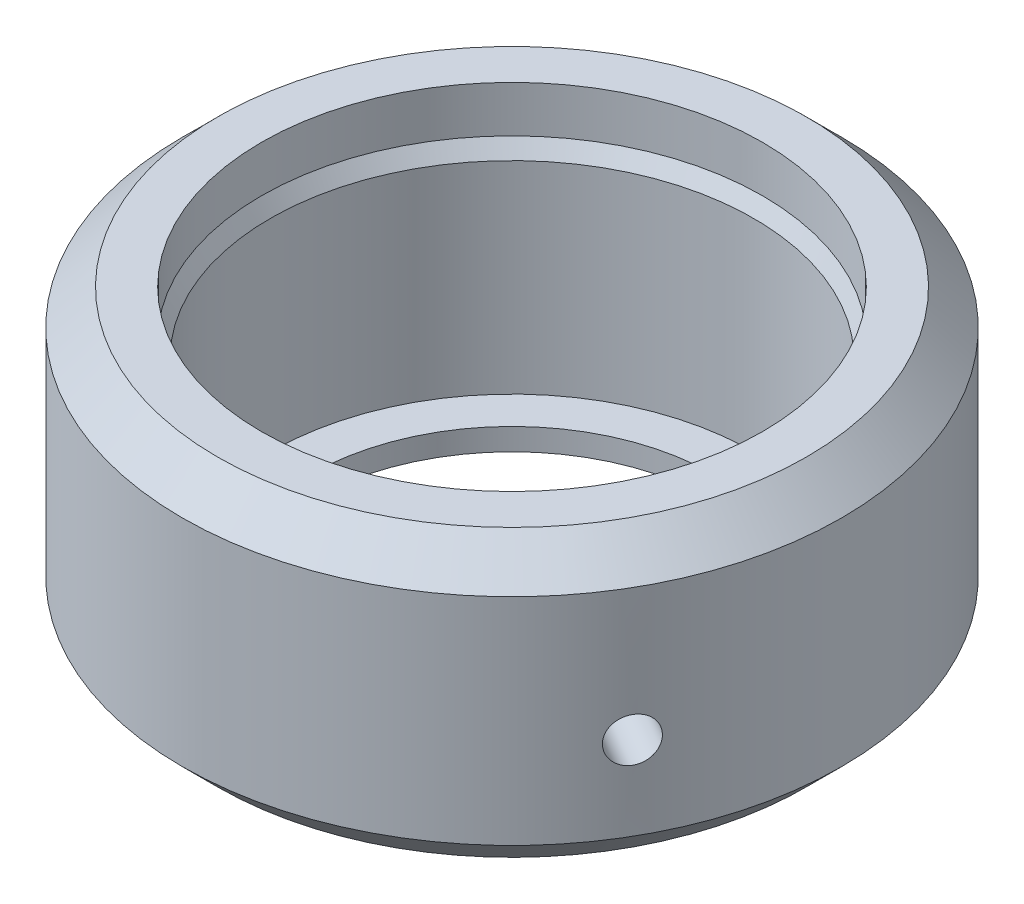
ISO-10303-21;
HEADER;
FILE_DESCRIPTION(('STEP AP214'),'2;1');
FILE_NAME('part.step','',(''),(''),'','','');
FILE_SCHEMA(('AUTOMOTIVE_DESIGN { 1 0 10303 214 1 1 1 1 }'));
ENDSEC;
DATA;
#1=APPLICATION_CONTEXT('core data for automotive mechanical design processes');
#2=APPLICATION_PROTOCOL_DEFINITION('international standard','automotive_design',2000,#1);
#3=PRODUCT_CONTEXT('',#1,'mechanical');
#4=PRODUCT('Part','Part','',(#3));
#5=PRODUCT_RELATED_PRODUCT_CATEGORY('part','',(#4));
#6=PRODUCT_DEFINITION_FORMATION('','',#4);
#7=PRODUCT_DEFINITION_CONTEXT('part definition',#1,'design');
#8=PRODUCT_DEFINITION('design','',#6,#7);
#9=PRODUCT_DEFINITION_SHAPE('','',#8);
#10=(LENGTH_UNIT() NAMED_UNIT(*) SI_UNIT(.MILLI.,.METRE.));
#11=(NAMED_UNIT(*) PLANE_ANGLE_UNIT() SI_UNIT($,.RADIAN.));
#12=(NAMED_UNIT(*) SI_UNIT($,.STERADIAN.) SOLID_ANGLE_UNIT());
#13=UNCERTAINTY_MEASURE_WITH_UNIT(LENGTH_MEASURE(1.E-05),#10,'distance_accuracy_value','');
#14=(GEOMETRIC_REPRESENTATION_CONTEXT(3) GLOBAL_UNCERTAINTY_ASSIGNED_CONTEXT((#13)) GLOBAL_UNIT_ASSIGNED_CONTEXT((#10,
#11,#12)) REPRESENTATION_CONTEXT('',''));
#15=CARTESIAN_POINT('',(0.,0.,0.));
#16=DIRECTION('',(0.,0.,1.));
#17=DIRECTION('',(1.,0.,0.));
#18=AXIS2_PLACEMENT_3D('',#15,#16,#17);
#19=CARTESIAN_POINT('',(0.,5.,0.));
#20=DIRECTION('',(0.,1.,0.));
#21=DIRECTION('',(0.,0.,1.));
#22=AXIS2_PLACEMENT_3D('',#19,#20,#21);
#23=PLANE('',#22);
#24=CARTESIAN_POINT('',(0.,5.,0.));
#25=DIRECTION('',(0.,1.,0.));
#26=DIRECTION('',(0.,0.,1.));
#27=AXIS2_PLACEMENT_3D('',#24,#25,#26);
#28=CIRCLE('',#27,46.);
#29=CARTESIAN_POINT('',(0.,5.,46.0000000000002));
#30=VERTEX_POINT('',#29);
#31=EDGE_CURVE('E17',#30,#30,#28,.F.);
#32=ORIENTED_EDGE('',*,*,#31,.T.);
#33=EDGE_LOOP('',(#32));
#34=FACE_BOUND('',#33,.T.);
#35=CARTESIAN_POINT('',(0.,5.,0.));
#36=DIRECTION('',(0.,1.,0.));
#37=DIRECTION('',(0.,0.,1.));
#38=AXIS2_PLACEMENT_3D('',#35,#36,#37);
#39=CIRCLE('',#38,55.);
#40=CARTESIAN_POINT('',(0.,5.,55.0000000000002));
#41=VERTEX_POINT('',#40);
#42=EDGE_CURVE('E115',#41,#41,#39,.T.);
#43=ORIENTED_EDGE('',*,*,#42,.T.);
#44=EDGE_LOOP('',(#43));
#45=FACE_BOUND('',#44,.T.);
#46=ADVANCED_FACE('F14',(#34,#45),#23,.T.);
#47=CARTESIAN_POINT('',(0.,54.4641016151031,0.));
#48=DIRECTION('',(0.,1.,0.));
#49=DIRECTION('',(0.,0.,1.));
#50=AXIS2_PLACEMENT_3D('',#47,#48,#49);
#51=CONICAL_SURFACE('',#50,56.9999999999946,0.523598775598);
#52=CARTESIAN_POINT('',(0.,51.,0.));
#53=DIRECTION('',(0.,1.,0.));
#54=DIRECTION('',(0.,0.,1.));
#55=AXIS2_PLACEMENT_3D('',#52,#53,#54);
#56=CIRCLE('',#55,55.);
#57=CARTESIAN_POINT('',(0.,51.,55.0000000000002));
#58=VERTEX_POINT('',#57);
#59=EDGE_CURVE('E30',#58,#58,#56,.F.);
#60=ORIENTED_EDGE('',*,*,#59,.T.);
#61=EDGE_LOOP('',(#60));
#62=FACE_BOUND('',#61,.T.);
#63=CARTESIAN_POINT('',(0.,54.4641016151,0.));
#64=DIRECTION('',(0.,1.,0.));
#65=DIRECTION('',(0.,0.,1.));
#66=AXIS2_PLACEMENT_3D('',#63,#64,#65);
#67=CIRCLE('',#66,57.);
#68=CARTESIAN_POINT('',(0.,54.4641016151,57.0000000000002));
#69=VERTEX_POINT('',#68);
#70=EDGE_CURVE('E112',#69,#69,#67,.T.);
#71=ORIENTED_EDGE('',*,*,#70,.T.);
#72=EDGE_LOOP('',(#71));
#73=FACE_BOUND('',#72,.T.);
#74=ADVANCED_FACE('F99',(#62,#73),#51,.F.);
#75=CARTESIAN_POINT('',(0.,-14.8,0.));
#76=DIRECTION('',(0.,1.,0.));
#77=DIRECTION('',(0.,0.,1.));
#78=AXIS2_PLACEMENT_3D('',#75,#76,#77);
#79=CYLINDRICAL_SURFACE('',#78,46.);
#80=CARTESIAN_POINT('',(0.,0.,0.));
#81=DIRECTION('',(0.,1.,0.));
#82=DIRECTION('',(0.,0.,1.));
#83=AXIS2_PLACEMENT_3D('',#80,#81,#82);
#84=CIRCLE('',#83,46.);
#85=CARTESIAN_POINT('',(0.,0.,46.0000000000002));
#86=VERTEX_POINT('',#85);
#87=EDGE_CURVE('E83',#86,#86,#84,.F.);
#88=ORIENTED_EDGE('',*,*,#87,.T.);
#89=EDGE_LOOP('',(#88));
#90=FACE_BOUND('',#89,.T.);
#91=ORIENTED_EDGE('',*,*,#31,.F.);
#92=EDGE_LOOP('',(#91));
#93=FACE_BOUND('',#92,.T.);
#94=ADVANCED_FACE('F96',(#90,#93),#79,.F.);
#95=CARTESIAN_POINT('',(0.,0.22679491924299,0.));
#96=DIRECTION('',(0.,1.,0.));
#97=DIRECTION('',(0.,0.,1.));
#98=AXIS2_PLACEMENT_3D('',#95,#96,#97);
#99=CYLINDRICAL_SURFACE('',#98,55.);
#100=ORIENTED_EDGE('',*,*,#42,.F.);
#101=EDGE_LOOP('',(#100));
#102=FACE_BOUND('',#101,.T.);
#103=CARTESIAN_POINT('',(49.9341649025131,27.,23.0560008563493));
#104=CARTESIAN_POINT('',(49.9341646831102,27.1400524558636,23.0560016059473));
#105=CARTESIAN_POINT('',(49.9316866792323,27.2801286113786,23.0613704849242));
#106=CARTESIAN_POINT('',(49.921779881773,27.5593390878845,23.0828080834393));
#107=CARTESIAN_POINT('',(49.9143486889914,27.6984729194302,23.0988819882195));
#108=CARTESIAN_POINT('',(49.8945413156315,27.9749887511214,23.1416356996972));
#109=CARTESIAN_POINT('',(49.8821568467968,28.1123674147542,23.1683332824835));
#110=CARTESIAN_POINT('',(49.8524789423698,28.3842029225961,23.2321238704768));
#111=CARTESIAN_POINT('',(49.8351836552419,28.5186586441388,23.2692207965018));
#112=CARTESIAN_POINT('',(49.7957718035332,28.7834637683972,23.3534423018323));
#113=CARTESIAN_POINT('',(49.7736617196796,28.9138184238086,23.4005534000239));
#114=CARTESIAN_POINT('',(49.7246754070136,29.1697369217856,23.5044666833726));
#115=CARTESIAN_POINT('',(49.6977974210375,29.295298977283,23.5612724411077));
#116=CARTESIAN_POINT('',(49.6394022951887,29.5405981238877,23.6840527514006));
#117=CARTESIAN_POINT('',(49.6078889564004,29.6603398817251,23.7500197890685));
#118=CARTESIAN_POINT('',(49.5403131644785,29.8933127354318,23.8906562787398));
#119=CARTESIAN_POINT('',(49.5042490317675,30.0065414049146,23.965328942981));
#120=CARTESIAN_POINT('',(49.4276305274475,30.2259130669552,24.1229566046697));
#121=CARTESIAN_POINT('',(49.38706551852,30.3320382806392,24.2059311752824));
#122=CARTESIAN_POINT('',(49.301669790968,30.5361945581048,24.3793909190932));
#123=CARTESIAN_POINT('',(49.2568375011666,30.6342226155753,24.4698788570723));
#124=CARTESIAN_POINT('',(49.1631301420866,30.8214247144554,24.6576080437347));
#125=CARTESIAN_POINT('',(49.1142561889423,30.9106011854254,24.7548474267759));
#126=CARTESIAN_POINT('',(49.0126639626494,31.0795321555249,24.955388355847));
#127=CARTESIAN_POINT('',(48.9599442773915,31.1592831652817,25.0586921259047));
#128=CARTESIAN_POINT('',(48.8508635838259,31.3088591290109,25.2706816586985));
#129=CARTESIAN_POINT('',(48.7944977824968,31.3786706147861,25.3793744599361));
#130=CARTESIAN_POINT('',(48.6784652876513,31.5077637936087,25.60122450016));
#131=CARTESIAN_POINT('',(48.6187973791333,31.5670415765693,25.7143833779752));
#132=CARTESIAN_POINT('',(48.496530824468,31.6745871169517,25.9442366959176));
#133=CARTESIAN_POINT('',(48.433933351637,31.7228592375172,26.0609297140937));
#134=CARTESIAN_POINT('',(48.3061549500616,31.8080866118852,26.2970239837128));
#135=CARTESIAN_POINT('',(48.2409730665323,31.8450376383845,26.4164262289521));
#136=CARTESIAN_POINT('',(48.0425739195284,31.9382470752399,26.7765886198404));
#137=CARTESIAN_POINT('',(47.9060258717884,31.9772811093191,27.0202039873204));
#138=CARTESIAN_POINT('',(47.6278765262338,32.0078811155544,27.5075274216296));
#139=CARTESIAN_POINT('',(47.4862753294995,31.9994480366877,27.7512354865081));
#140=CARTESIAN_POINT('',(47.2735075651726,31.9515812340089,28.111119446485));
#141=CARTESIAN_POINT('',(47.2025912466279,31.9297933115948,28.230024593226));
#142=CARTESIAN_POINT('',(47.0610783765542,31.8746909347558,28.4653066891305));
#143=CARTESIAN_POINT('',(46.9904817153743,31.8413807933298,28.5816845670026));
#144=CARTESIAN_POINT('',(46.8501289950334,31.7634554823515,28.8111702280207));
#145=CARTESIAN_POINT('',(46.7803732711757,31.7188359500873,28.9242767303985));
#146=CARTESIAN_POINT('',(46.6423122412645,31.6186382637428,29.1463856702374));
#147=CARTESIAN_POINT('',(46.5740064158555,31.5630641095839,29.2553895884477));
#148=CARTESIAN_POINT('',(46.4392594866768,31.4412301635672,29.4688163765051));
#149=CARTESIAN_POINT('',(46.3728220921961,31.3749506659595,29.5732303376762));
#150=CARTESIAN_POINT('',(46.2425325459328,31.2322782681089,29.7765471282466));
#151=CARTESIAN_POINT('',(46.1786794599752,31.1558890657349,29.8754519540399));
#152=CARTESIAN_POINT('',(46.0540678437818,30.9934940842435,30.0671900036576));
#153=CARTESIAN_POINT('',(45.9933102593299,30.9074853913798,30.1600213742618));
#154=CARTESIAN_POINT('',(45.8754705872488,30.7265090360886,30.3389629623674));
#155=CARTESIAN_POINT('',(45.8183871660025,30.6315446555295,30.4250756210069));
#156=CARTESIAN_POINT('',(45.708178208396,30.4329186829776,30.5903964408344));
#157=CARTESIAN_POINT('',(45.6550685357963,30.3292254137512,30.6695771223033));
#158=CARTESIAN_POINT('',(45.5535598771481,30.1142256381615,30.8201464339936));
#159=CARTESIAN_POINT('',(45.5051591688543,30.0029219407716,30.8915379141877));
#160=CARTESIAN_POINT('',(45.4134653975181,29.7733544778493,31.0261793157647));
#161=CARTESIAN_POINT('',(45.3701766452193,29.6550849624488,31.0894223698836));
#162=CARTESIAN_POINT('',(45.2891862816462,29.4125506682876,31.207286320829));
#163=CARTESIAN_POINT('',(45.2514825979058,29.2882881361751,31.2619104164079));
#164=CARTESIAN_POINT('',(45.1819650183468,29.0344330944784,31.3622985786139));
#165=CARTESIAN_POINT('',(45.1501592231565,28.9048335486517,31.4080504633292));
#166=CARTESIAN_POINT('',(45.0928290437923,28.6414347641686,31.4903045918895));
#167=CARTESIAN_POINT('',(45.0673022796642,28.5076371384685,31.526810340473));
#168=CARTESIAN_POINT('',(45.0228100827017,28.2369853358394,31.5903161351384));
#169=CARTESIAN_POINT('',(45.0038335735913,28.1001367394367,31.6173322293056));
#170=CARTESIAN_POINT('',(44.9725819798215,27.8241921578405,31.6617689349638));
#171=CARTESIAN_POINT('',(44.960303620002,27.685097305306,31.6791942360535));
#172=CARTESIAN_POINT('',(44.9456840835576,27.4548371097946,31.6999301890015));
#173=CARTESIAN_POINT('',(44.9413663255225,27.3640361798798,31.7060501769075));
#174=CARTESIAN_POINT('',(44.9356065593278,27.1821601747837,31.7142127135206));
#175=CARTESIAN_POINT('',(44.9341645516674,27.0910850995548,31.7162552615199));
#176=CARTESIAN_POINT('',(44.9341654419895,26.8599475441367,31.7162543293848));
#177=CARTESIAN_POINT('',(44.9375760256321,26.7198713886219,31.7114238755805));
#178=CARTESIAN_POINT('',(44.9511881318109,26.4406609121163,31.6921255380479));
#179=CARTESIAN_POINT('',(44.9613929452984,26.3015270805706,31.6776529839304));
#180=CARTESIAN_POINT('',(44.9885150588647,26.0250112488792,31.6391224396811));
#181=CARTESIAN_POINT('',(45.0054436093598,25.8876325852462,31.6150483836644));
#182=CARTESIAN_POINT('',(45.0458489268707,25.6157970774041,31.5574512705021));
#183=CARTESIAN_POINT('',(45.0693281636467,25.4813413558614,31.5239246494708));
#184=CARTESIAN_POINT('',(45.1225602009537,25.2165362316026,31.4476822320157));
#185=CARTESIAN_POINT('',(45.1523045668611,25.0861815761911,31.4049787886232));
#186=CARTESIAN_POINT('',(45.2178029536988,24.8302630782139,31.3105987557426));
#187=CARTESIAN_POINT('',(45.2535591899906,24.7047010227165,31.2589188582171));
#188=CARTESIAN_POINT('',(45.3306924948645,24.4594018761118,31.1469570406283));
#189=CARTESIAN_POINT('',(45.3720649559033,24.3396601182745,31.0866821698458));
#190=CARTESIAN_POINT('',(45.4600718326965,24.1066872645679,30.9578415725248));
#191=CARTESIAN_POINT('',(45.5067081905416,23.9934585950852,30.8892727853108));
#192=CARTESIAN_POINT('',(45.6049084977432,23.7740869330448,30.7441053833255));
#193=CARTESIAN_POINT('',(45.6564840792986,23.6679617193608,30.6674877697836));
#194=CARTESIAN_POINT('',(45.7640067601971,23.4638054418953,30.5068030284439));
#195=CARTESIAN_POINT('',(45.8199554683222,23.3657773844248,30.4227331575765));
#196=CARTESIAN_POINT('',(45.9356800334636,23.1785752855448,30.2477156107604));
#197=CARTESIAN_POINT('',(45.9954548328536,23.0893988145748,30.1567698342335));
#198=CARTESIAN_POINT('',(46.1183322587813,22.9204678444752,29.9685179209014));
#199=CARTESIAN_POINT('',(46.1814361053291,22.8407168347182,29.8712094491599));
#200=CARTESIAN_POINT('',(46.3104840792821,22.691140870989,29.6707480310729));
#201=CARTESIAN_POINT('',(46.3764319056978,22.621329385214,29.5675874145983));
#202=CARTESIAN_POINT('',(46.5105434289397,22.4922362063915,29.3561753062857));
#203=CARTESIAN_POINT('',(46.5787079375324,22.4329584234309,29.2479219428109));
#204=CARTESIAN_POINT('',(46.7166334726821,22.3254128830485,29.0271093414665));
#205=CARTESIAN_POINT('',(46.7863938544513,22.277140762483,28.9145518306942));
#206=CARTESIAN_POINT('',(46.9269682888418,22.191913388115,28.6858453540655));
#207=CARTESIAN_POINT('',(46.9977827247234,22.1549623616155,28.5696950644432));
#208=CARTESIAN_POINT('',(47.2104929312189,22.0617529247599,28.2177951676047));
#209=CARTESIAN_POINT('',(47.353196004339,22.0227188906809,27.9777334056846));
#210=CARTESIAN_POINT('',(47.6361558055327,21.9921188844457,27.4931872892333));
#211=CARTESIAN_POINT('',(47.7764125824572,22.0005519633123,27.2487030232155));
#212=CARTESIAN_POINT('',(47.9816973520489,22.0484187659911,26.8844987542137));
#213=CARTESIAN_POINT('',(48.0492140704954,22.0702066884052,26.7636308474407));
#214=CARTESIAN_POINT('',(48.1822179075678,22.1253090652442,26.5234360590422));
#215=CARTESIAN_POINT('',(48.2477057756535,22.1586192066703,26.4041086181019));
#216=CARTESIAN_POINT('',(48.3762698277293,22.2365445176486,26.1678167662875));
#217=CARTESIAN_POINT('',(48.439345070193,22.2811640499128,26.0508532861786));
#218=CARTESIAN_POINT('',(48.5626665395452,22.3813617362573,25.820234457083));
#219=CARTESIAN_POINT('',(48.6229137891221,22.4369358904161,25.7065779179467));
#220=CARTESIAN_POINT('',(48.7403733448386,22.5587698364328,25.4831702601674));
#221=CARTESIAN_POINT('',(48.797579790483,22.6250493340406,25.373426808201));
#222=CARTESIAN_POINT('',(48.9085125230019,22.7677217318912,25.1589343560047));
#223=CARTESIAN_POINT('',(48.9622400717167,22.8441109342652,25.0541835485587));
#224=CARTESIAN_POINT('',(49.0659842854609,23.0065059157564,24.8503976985198));
#225=CARTESIAN_POINT('',(49.1159998184464,23.0925146086199,24.7513644016098));
#226=CARTESIAN_POINT('',(49.2120479434988,23.2734909639113,24.5598414579616));
#227=CARTESIAN_POINT('',(49.2580819828447,23.3684553444707,24.4673494357079));
#228=CARTESIAN_POINT('',(49.3461495337867,23.5670813170225,24.2892452687823));
#229=CARTESIAN_POINT('',(49.388167179128,23.6707745862486,24.2036606023896));
#230=CARTESIAN_POINT('',(49.4678096987583,23.8857743618382,24.0404668694508));
#231=CARTESIAN_POINT('',(49.5054361800733,23.9970780592281,23.9628548864101));
#232=CARTESIAN_POINT('',(49.576192168572,24.2266455221507,23.8161250502758));
#233=CARTESIAN_POINT('',(49.6093178839025,24.3449150375512,23.7470143640274));
#234=CARTESIAN_POINT('',(49.6708958778254,24.5874493317125,23.6179426762385));
#235=CARTESIAN_POINT('',(49.6993498903856,24.7117118638249,23.5579782805134));
#236=CARTESIAN_POINT('',(49.7515297993158,24.9655669055217,23.4475802095027));
#237=CARTESIAN_POINT('',(49.7752491961549,25.0951664513486,23.3971596405229));
#238=CARTESIAN_POINT('',(49.8178182713719,25.3585652358319,23.3063831845099));
#239=CARTESIAN_POINT('',(49.8366697949653,25.492362861532,23.2660234840069));
#240=CARTESIAN_POINT('',(49.8694213279521,25.763014664161,23.1957392138344));
#241=CARTESIAN_POINT('',(49.8833296972571,25.8998632605636,23.165797027786));
#242=CARTESIAN_POINT('',(49.9061872163318,26.1758078421597,23.1165140008438));
#243=CARTESIAN_POINT('',(49.9151387898332,26.3149026946942,23.0971679787788));
#244=CARTESIAN_POINT('',(49.9257868836373,26.5451628902055,23.074139112352));
#245=CARTESIAN_POINT('',(49.9289280696188,26.6359638201202,23.0673398302529));
#246=CARTESIAN_POINT('',(49.9331171505843,26.8178398252162,23.0582704581025));
#247=CARTESIAN_POINT('',(49.9341650452048,26.9089149004452,23.0560003688376));
#248=CARTESIAN_POINT('',(49.9341649025131,27.,23.0560008563493));
#249=B_SPLINE_CURVE_WITH_KNOTS('',3,(#103,#104,#105,#106,#107,#108,#109,#110,#111,#112,#113,
#114,#115,#116,#117,#118,#119,#120,#121,#122,#123,#124,#125,#126,#127,#128,#129,#130,#131,#132,
#133,#134,#135,#136,#137,#138,#139,#140,#141,#142,#143,#144,#145,#146,#147,#148,#149,#150,#151,
#152,#153,#154,#155,#156,#157,#158,#159,#160,#161,#162,#163,#164,#165,#166,#167,#168,#169,#170,
#171,#172,#173,#174,#175,#176,#177,#178,#179,#180,#181,#182,#183,#184,#185,#186,#187,#188,#189,
#190,#191,#192,#193,#194,#195,#196,#197,#198,#199,#200,#201,#202,#203,#204,#205,#206,#207,#208,
#209,#210,#211,#212,#213,#214,#215,#216,#217,#218,#219,#220,#221,#222,#223,#224,#225,#226,#227,
#228,#229,#230,#231,#232,#233,#234,#235,#236,#237,#238,#239,#240,#241,#242,#243,#244,#245,#246,
#247,#248),.UNSPECIFIED.,.T.,.F.,(4,2,2,2,2,2,2,2,2,2,2,2,2,2,2,2,2,2,2,2,2,2,2,2,2,2,2,2,2,2,2,
2,2,2,2,2,2,2,2,2,2,2,2,2,2,2,2,2,2,2,2,2,2,2,2,2,2,2,2,2,2,2,2,2,2,2,2,2,2,2,2,2,4),(0.,
0.420073891223606,0.840351403678798,1.26133512336998,1.68247777863878,2.10305704063433,
2.52379162624808,2.94418310464868,3.36473019471148,3.78629326902502,4.2080121641945,
4.6296149851037,5.05137340067657,5.47369797416,5.89617898758636,6.31849221800032,
6.74096294877401,7.58264295393859,8.4243061320368,8.84434369757853,9.26422420443381,
9.68426693161968,10.1041565694483,10.524828112727,10.9453462083092,11.3659920256775,
11.7864842893233,12.2085743769585,12.6305095054295,13.0527979348018,13.4749292698354,
13.8976361673013,14.3201825975522,14.7420109739493,15.1636329057662,15.4368338669647,
15.7100348755908,16.1301087668138,16.5503862792691,16.9713699989606,17.39251265423,
17.8130919162257,18.2338265018397,18.6542179802401,19.0747650703026,19.4963281446159,
19.9180470397852,20.3396498606944,20.7614082762673,21.1837328497506,21.6062138631769,
22.0285270935907,22.4509978243642,23.2926778295292,24.1343410076279,24.5543785731697,
24.9742590800251,25.3943018072111,25.8141914450398,26.2348629883183,26.6553810839002,
27.0760269012683,27.4965191649139,27.9186092525492,28.3405443810203,28.7628328103929,
29.1849641454268,29.6076710428927,30.0302174731438,30.4520458495405,30.8736677813574,
31.1468687425557,31.4200697511817),.UNSPECIFIED.);
#250=CARTESIAN_POINT('',(49.9341649025131,27.,23.0560008563493));
#251=VERTEX_POINT('',#250);
#252=EDGE_CURVE('E79',#251,#251,#249,.T.);
#253=ORIENTED_EDGE('',*,*,#252,.T.);
#254=EDGE_LOOP('',(#253));
#255=FACE_BOUND('',#254,.T.);
#256=ORIENTED_EDGE('',*,*,#59,.F.);
#257=EDGE_LOOP('',(#256));
#258=FACE_BOUND('',#257,.T.);
#259=ADVANCED_FACE('F90',(#102,#255,#258),#99,.F.);
#260=CARTESIAN_POINT('',(0.,0.22679491924299,0.));
#261=DIRECTION('',(0.,1.,0.));
#262=DIRECTION('',(0.,0.,1.));
#263=AXIS2_PLACEMENT_3D('',#260,#261,#262);
#264=CYLINDRICAL_SURFACE('',#263,57.);
#265=ORIENTED_EDGE('',*,*,#70,.F.);
#266=EDGE_LOOP('',(#265));
#267=FACE_BOUND('',#266,.T.);
#268=CARTESIAN_POINT('',(0.,65.,0.));
#269=DIRECTION('',(0.,1.,0.));
#270=DIRECTION('',(0.,0.,1.));
#271=AXIS2_PLACEMENT_3D('',#268,#269,#270);
#272=CIRCLE('',#271,57.);
#273=CARTESIAN_POINT('',(0.,65.,57.0000000000002));
#274=VERTEX_POINT('',#273);
#275=EDGE_CURVE('E75',#274,#274,#272,.F.);
#276=ORIENTED_EDGE('',*,*,#275,.F.);
#277=EDGE_LOOP('',(#276));
#278=FACE_BOUND('',#277,.T.);
#279=ADVANCED_FACE('F95',(#267,#278),#264,.F.);
#280=CARTESIAN_POINT('',(0.,0.,0.));
#281=DIRECTION('',(0.,1.,0.));
#282=DIRECTION('',(0.,0.,1.));
#283=AXIS2_PLACEMENT_3D('',#280,#281,#282);
#284=PLANE('',#283);
#285=ORIENTED_EDGE('',*,*,#87,.F.);
#286=EDGE_LOOP('',(#285));
#287=FACE_BOUND('',#286,.T.);
#288=CARTESIAN_POINT('',(0.,0.,0.));
#289=DIRECTION('',(0.,1.,0.));
#290=DIRECTION('',(0.,0.,1.));
#291=AXIS2_PLACEMENT_3D('',#288,#289,#290);
#292=CIRCLE('',#291,66.9999862654897);
#293=CARTESIAN_POINT('',(0.,0.,66.99998626549));
#294=VERTEX_POINT('',#293);
#295=EDGE_CURVE('E45',#294,#294,#292,.T.);
#296=ORIENTED_EDGE('',*,*,#295,.F.);
#297=EDGE_LOOP('',(#296));
#298=FACE_BOUND('',#297,.T.);
#299=ADVANCED_FACE('F70',(#287,#298),#284,.F.);
#300=CARTESIAN_POINT('',(64.9519052838002,27.,37.5000000000001));
#301=DIRECTION('',(-0.866025403784333,0.,-0.500000000000192));
#302=DIRECTION('',(-0.500000000000192,0.,0.866025403784333));
#303=AXIS2_PLACEMENT_3D('',#300,#301,#302);
#304=CYLINDRICAL_SURFACE('',#303,5.);
#305=CARTESIAN_POINT('',(62.3074069840701,27.,41.7467008866759));
#306=CARTESIAN_POINT('',(62.3074074861112,27.1401994469576,41.7467002911992));
#307=CARTESIAN_POINT('',(62.3106999599185,27.2804233951994,41.7417873824171));
#308=CARTESIAN_POINT('',(62.323843281868,27.5599302769908,41.7221607084198));
#309=CARTESIAN_POINT('',(62.333697333337,27.6992127173359,41.7074421561408));
#310=CARTESIAN_POINT('',(62.359896051621,27.976028719541,41.6682603521341));
#311=CARTESIAN_POINT('',(62.3762516889803,28.1135589178318,41.6437806295385));
#312=CARTESIAN_POINT('',(62.415307418382,28.3856967596065,41.5852213803083));
#313=CARTESIAN_POINT('',(62.4380099004095,28.5203032815251,41.5511382373459));
#314=CARTESIAN_POINT('',(62.4895120149786,28.7854143956203,41.4736428107761));
#315=CARTESIAN_POINT('',(62.5183038236182,28.9159240069548,41.430242497315));
#316=CARTESIAN_POINT('',(62.5817482069081,29.1721440348353,41.3343452317404));
#317=CARTESIAN_POINT('',(62.6164029415956,29.2978526615891,41.2818449268043));
#318=CARTESIAN_POINT('',(62.6912183925425,29.5434290589724,41.1681401283053));
#319=CARTESIAN_POINT('',(62.7313745261002,29.6633015796371,41.1069428777884));
#320=CARTESIAN_POINT('',(62.8168688814519,29.8965153291553,40.9761770512114));
#321=CARTESIAN_POINT('',(62.8622090131763,30.009854127519,40.9066053892815));
#322=CARTESIAN_POINT('',(62.9577143990442,30.2292873172563,40.7594638962406));
#323=CARTESIAN_POINT('',(63.007885459826,30.3353727217422,40.6818844317144));
#324=CARTESIAN_POINT('',(63.1125847140798,30.5394359359608,40.5192670571246));
#325=CARTESIAN_POINT('',(63.1671145105731,30.6374107356226,40.4342264019104));
#326=CARTESIAN_POINT('',(63.2800271290261,30.8244897774912,40.2572872241692));
#327=CARTESIAN_POINT('',(63.3384088724223,30.9135964854236,40.1653906204059));
#328=CARTESIAN_POINT('',(63.4585638009291,31.0823704039535,39.9752839517125));
#329=CARTESIAN_POINT('',(63.5203382300092,31.1620341178896,39.8770715687384));
#330=CARTESIAN_POINT('',(63.646775006089,31.3113573319504,39.6749573884015));
#331=CARTESIAN_POINT('',(63.7114388662406,31.3810115077936,39.5710526034193));
#332=CARTESIAN_POINT('',(63.8431138234917,31.5097919133777,39.3582581000633));
#333=CARTESIAN_POINT('',(63.9101257801332,31.5689142386251,39.2493665516661));
#334=CARTESIAN_POINT('',(64.0459112586071,31.6761551761755,39.0274025779542));
#335=CARTESIAN_POINT('',(64.1146840826765,31.7242780743165,38.9143318010609));
#336=CARTESIAN_POINT('',(64.2534751677,31.8092171999472,38.6847383654824));
#337=CARTESIAN_POINT('',(64.3234938843054,31.8460291969741,38.5682144330829));
#338=CARTESIAN_POINT('',(64.534326996492,31.9389240389083,38.2151191460154));
#339=CARTESIAN_POINT('',(64.6762730720846,31.9777446610178,37.9744454728639));
#340=CARTESIAN_POINT('',(64.9586925587563,32.0078785442037,37.4892920829424));
#341=CARTESIAN_POINT('',(65.0991659856975,31.9991923175098,37.2448124072381));
#342=CARTESIAN_POINT('',(65.3055882374115,31.9508965648093,36.8808861614255));
#343=CARTESIAN_POINT('',(65.3736638473385,31.9289305459991,36.7600740355215));
#344=CARTESIAN_POINT('',(65.508005076198,31.8734301566731,36.5201329772486));
#345=CARTESIAN_POINT('',(65.5742713625433,31.8399001157823,36.4010034322655));
#346=CARTESIAN_POINT('',(65.7045921115779,31.7614928874274,36.1652421986606));
#347=CARTESIAN_POINT('',(65.76864571357,31.7166113396702,36.0486114885963));
#348=CARTESIAN_POINT('',(65.8940961689231,31.6158478634393,35.818783065464));
#349=CARTESIAN_POINT('',(65.9554939878313,31.5599699745472,35.7055841092883));
#350=CARTESIAN_POINT('',(66.0753574380405,31.4375278369065,35.4832792879563));
#351=CARTESIAN_POINT('',(66.1338194615708,31.3709508424793,35.3741784985544));
#352=CARTESIAN_POINT('',(66.2473706910374,31.2276587584922,35.1610644214211));
#353=CARTESIAN_POINT('',(66.3024611261532,31.1509473962229,35.0570492824301));
#354=CARTESIAN_POINT('',(66.4089985915394,30.9878873826605,34.8548127988403));
#355=CARTESIAN_POINT('',(66.4604445452444,30.9015359029581,34.7565931676313));
#356=CARTESIAN_POINT('',(66.5593780148241,30.7198582192045,34.5667564779847));
#357=CARTESIAN_POINT('',(66.6068669763501,30.6245353201244,34.4751370099089));
#358=CARTESIAN_POINT('',(66.6977554627325,30.4253486104688,34.2989688470938));
#359=CARTESIAN_POINT('',(66.7411460838704,30.3214670823713,34.2144355901168));
#360=CARTESIAN_POINT('',(66.8234873741323,30.1061140258596,34.0533363760884));
#361=CARTESIAN_POINT('',(66.8624396710157,29.9946453041694,33.9767674989971));
#362=CARTESIAN_POINT('',(66.9357611767426,29.7647750296689,33.8320921722316));
#363=CARTESIAN_POINT('',(66.9701265084102,29.646367732082,33.7639928848336));
#364=CARTESIAN_POINT('',(67.0340579697724,29.4035895002709,33.6368865036271));
#365=CARTESIAN_POINT('',(67.0636258735213,29.2792207926738,33.5778760492449));
#366=CARTESIAN_POINT('',(67.1178732325255,29.0251994447716,33.4693110480966));
#367=CARTESIAN_POINT('',(67.1425464159366,28.895540278629,33.4197686361357));
#368=CARTESIAN_POINT('',(67.1868345983051,28.6320588432694,33.3306425710747));
#369=CARTESIAN_POINT('',(67.2064515063953,28.4982381667934,33.2910551593346));
#370=CARTESIAN_POINT('',(67.2405207487786,28.2275767956956,33.2221890211942));
#371=CARTESIAN_POINT('',(67.2549818232517,28.0907416335025,33.1928928503146));
#372=CARTESIAN_POINT('',(67.2787156723391,27.8148567991697,33.1447603955084));
#373=CARTESIAN_POINT('',(67.2879909905841,27.6758082471892,33.1259189835218));
#374=CARTESIAN_POINT('',(67.2989043125698,27.4471276494529,33.1037394138415));
#375=CARTESIAN_POINT('',(67.3020921105016,27.3578597473958,33.097256998819));
#376=CARTESIAN_POINT('',(67.3063435308543,27.179064561302,33.0886104822335));
#377=CARTESIAN_POINT('',(67.3074071531056,27.0895372772445,33.0864463810151));
#378=CARTESIAN_POINT('',(67.3074067193938,26.8598005530423,33.0864475813513));
#379=CARTESIAN_POINT('',(67.3047982524864,26.7195766048005,33.0917554017005));
#380=CARTESIAN_POINT('',(67.2943727151883,26.440069723009,33.1129511893974));
#381=CARTESIAN_POINT('',(67.286553100742,26.300787282664,33.1288443244392));
#382=CARTESIAN_POINT('',(67.265720022248,26.023971280459,33.1711239820232));
#383=CARTESIAN_POINT('',(67.2526977792821,25.8864410821681,33.1975282407692));
#384=CARTESIAN_POINT('',(67.2215118465232,25.6143032403934,33.2606311192095));
#385=CARTESIAN_POINT('',(67.2033462198907,25.4796967184749,33.2973336168555));
#386=CARTESIAN_POINT('',(67.1619842690887,25.2145856043797,33.3806834697058));
#387=CARTESIAN_POINT('',(67.1387943994189,25.0840759930453,33.4273180641392));
#388=CARTESIAN_POINT('',(67.0874671229227,24.8278559651647,33.5302111445829));
#389=CARTESIAN_POINT('',(67.0593278924854,24.702147338411,33.5864731776517));
#390=CARTESIAN_POINT('',(66.9982643739264,24.4565709410277,33.7081176580168));
#391=CARTESIAN_POINT('',(66.9653440671158,24.3366984203631,33.773492515054));
#392=CARTESIAN_POINT('',(66.8948447170292,24.1034846708448,33.912915711957));
#393=CARTESIAN_POINT('',(66.8572639562767,23.990145872481,33.9869672488063));
#394=CARTESIAN_POINT('',(66.7775883782865,23.7707126827437,34.1432480856866));
#395=CARTESIAN_POINT('',(66.7354881215854,23.6646272782578,34.2254872311215));
#396=CARTESIAN_POINT('',(66.6470069712205,23.4605640640392,34.3974681323575));
#397=CARTESIAN_POINT('',(66.6006245016972,23.3625892643773,34.487212648991));
#398=CARTESIAN_POINT('',(66.5038469880751,23.1755102225087,34.6734674338497));
#399=CARTESIAN_POINT('',(66.4534530663928,23.0864035145762,34.7699758086298));
#400=CARTESIAN_POINT('',(66.3488933261283,22.9176295960464,34.9690863634532));
#401=CARTESIAN_POINT('',(66.294726122046,22.8379658821104,35.0716907798277));
#402=CARTESIAN_POINT('',(66.1829084954489,22.6886426680496,35.2822453300538));
#403=CARTESIAN_POINT('',(66.1252562421559,22.6189884922063,35.3901982681432));
#404=CARTESIAN_POINT('',(66.0068082750898,22.4902080866221,35.6106293778429));
#405=CARTESIAN_POINT('',(65.9460114062409,22.4310857613748,35.7231092088503));
#406=CARTESIAN_POINT('',(65.8216777055183,22.3238448238245,35.9516848695295));
#407=CARTESIAN_POINT('',(65.7581419523377,22.2757219256834,36.0677792707103));
#408=CARTESIAN_POINT('',(65.6287037470962,22.1907828000528,36.3027725939486));
#409=CARTESIAN_POINT('',(65.5628004197919,22.1539708030259,36.4216725474689));
#410=CARTESIAN_POINT('',(65.362427487328,22.0610759610918,36.7808070221151));
#411=CARTESIAN_POINT('',(65.224971010153,22.0222553389822,37.0240727661216));
#412=CARTESIAN_POINT('',(64.9460255930845,21.9921214557962,37.5112319110638));
#413=CARTESIAN_POINT('',(64.8045366966858,22.0008076824901,37.7551253052036));
#414=CARTESIAN_POINT('',(64.5925784485651,22.0491034351907,38.1158553420006));
#415=CARTESIAN_POINT('',(64.5219898834105,22.071069454001,38.2352166125275));
#416=CARTESIAN_POINT('',(64.381365445965,22.126569843327,38.4715300586318));
#417=CARTESIAN_POINT('',(64.311329376841,22.1600998842178,38.5884831185127));
#418=CARTESIAN_POINT('',(64.1723145338288,22.2385071125727,38.8192248146193));
#419=CARTESIAN_POINT('',(64.1033361770478,22.2833886603299,38.9330122161804));
#420=CARTESIAN_POINT('',(63.9670241517799,22.3841521365607,39.1565697089985));
#421=CARTESIAN_POINT('',(63.8996898895038,22.4400300254528,39.2663412579977));
#422=CARTESIAN_POINT('',(63.7670999919511,22.5624721630935,39.48129846153));
#423=CARTESIAN_POINT('',(63.7018469485213,22.6290491575207,39.5864784537648));
#424=CARTESIAN_POINT('',(63.5740603585532,22.7723412415078,39.7913737416805));
#425=CARTESIAN_POINT('',(63.5115258233666,22.8490526037771,39.8910910274917));
#426=CARTESIAN_POINT('',(63.3896526236987,23.0121126173395,40.0844734207658));
#427=CARTESIAN_POINT('',(63.3303149047739,23.0984640970419,40.1781367392007));
#428=CARTESIAN_POINT('',(63.2153782437594,23.2801417807955,40.3587339819645));
#429=CARTESIAN_POINT('',(63.1597779376875,23.3754646798756,40.4456703630833));
#430=CARTESIAN_POINT('',(63.0526560765427,23.5746513895312,40.6124661826095));
#431=CARTESIAN_POINT('',(63.0011434391048,23.6785329176287,40.6923101912894));
#432=CARTESIAN_POINT('',(62.9027980723574,23.8938859741405,40.8441694474508));
#433=CARTESIAN_POINT('',(62.8559636280987,24.0053546958308,40.9161875646332));
#434=CARTESIAN_POINT('',(62.7673318726824,24.2352249703313,41.0520235146191));
#435=CARTESIAN_POINT('',(62.72553882565,24.3536322679183,41.1158344085517));
#436=CARTESIAN_POINT('',(62.6474272012229,24.5964104997293,41.2347538687958));
#437=CARTESIAN_POINT('',(62.6111066005132,24.7207792073262,41.2898656517702));
#438=CARTESIAN_POINT('',(62.5442102310589,24.9748005552284,41.3911277433301));
#439=CARTESIAN_POINT('',(62.5136418354419,25.1044597213711,41.4372665529366));
#440=CARTESIAN_POINT('',(62.4586004901442,25.3679411567307,41.5201842764854));
#441=CARTESIAN_POINT('',(62.4341252399521,25.5017618332066,41.5569667231053));
#442=CARTESIAN_POINT('',(62.3915200360537,25.7724232043044,41.6209046215673));
#443=CARTESIAN_POINT('',(62.373379345075,25.9092583664975,41.6480763648669));
#444=CARTESIAN_POINT('',(62.3435623410098,26.1851432008303,41.6926967085089));
#445=CARTESIAN_POINT('',(62.3318828587083,26.3241917528108,41.7101500757303));
#446=CARTESIAN_POINT('',(62.3181314489131,26.5528723505471,41.7306910746497));
#447=CARTESIAN_POINT('',(62.3141114117919,26.6421402526042,41.7366929961522));
#448=CARTESIAN_POINT('',(62.3087490189512,26.820935438698,41.7446980924731));
#449=CARTESIAN_POINT('',(62.3074066634455,26.9104627227555,41.7467012669725));
#450=CARTESIAN_POINT('',(62.3074069840701,27.,41.7467008866759));
#451=B_SPLINE_CURVE_WITH_KNOTS('',3,(#305,#306,#307,#308,#309,#310,#311,#312,#313,#314,#315,
#316,#317,#318,#319,#320,#321,#322,#323,#324,#325,#326,#327,#328,#329,#330,#331,#332,#333,#334,
#335,#336,#337,#338,#339,#340,#341,#342,#343,#344,#345,#346,#347,#348,#349,#350,#351,#352,#353,
#354,#355,#356,#357,#358,#359,#360,#361,#362,#363,#364,#365,#366,#367,#368,#369,#370,#371,#372,
#373,#374,#375,#376,#377,#378,#379,#380,#381,#382,#383,#384,#385,#386,#387,#388,#389,#390,#391,
#392,#393,#394,#395,#396,#397,#398,#399,#400,#401,#402,#403,#404,#405,#406,#407,#408,#409,#410,
#411,#412,#413,#414,#415,#416,#417,#418,#419,#420,#421,#422,#423,#424,#425,#426,#427,#428,#429,
#430,#431,#432,#433,#434,#435,#436,#437,#438,#439,#440,#441,#442,#443,#444,#445,#446,#447,#448,
#449,#450),.UNSPECIFIED.,.T.,.F.,(4,2,2,2,2,2,2,2,2,2,2,2,2,2,2,2,2,2,2,2,2,2,2,2,2,2,2,2,2,2,2,
2,2,2,2,2,2,2,2,2,2,2,2,2,2,2,2,2,2,2,2,2,2,2,2,2,2,2,2,2,2,2,2,2,2,2,2,2,2,2,2,2,4),(0.,
0.420516327912893,0.841238100281724,1.26267281765865,1.68426644588358,2.10532164293367,
2.52653230560852,2.94739420659732,3.36841166763916,3.78994165134159,4.21162738165719,
4.6331955349939,5.0549193070221,5.47686657888029,5.89896995599347,6.32090858249302,
6.74300482940609,7.58502365274794,8.42703339726766,8.84781930867874,9.26844784656284,
9.68923820054358,10.1098742618852,10.531015186591,10.952001650037,11.3731119571063,
11.7940677345511,12.2159179668344,12.6376129837747,13.0596622152127,13.4815550184132,
13.9039849705004,14.3262551883718,14.7478061306443,15.169150118954,15.4377095523259,
15.7062690071256,16.1267853350386,16.5475071074075,16.9689418247843,17.3905354530092,
17.8115906500592,18.232801312734,18.6536632137228,19.0746806747647,19.4962106584672,
19.9178963887829,20.3394645421197,20.7611883141481,21.1831355860062,21.6052389631194,
22.0271775896189,22.4492738365319,23.2912926598739,24.1333024043939,24.5540883158048,
24.9747168536888,25.3955072076695,25.816143269011,26.2372841937167,26.6582706571627,
27.079380964232,27.5003367416767,27.9221869739601,28.3438819909006,28.7659312223386,
29.1878240255391,29.6102539776262,30.0325241954974,30.45407513777,30.8754191260796,
31.1439785594516,31.4125380142513),.UNSPECIFIED.);
#452=CARTESIAN_POINT('',(62.3074069840701,27.,41.7467008866759));
#453=VERTEX_POINT('',#452);
#454=EDGE_CURVE('E36',#453,#453,#451,.T.);
#455=ORIENTED_EDGE('',*,*,#454,.F.);
#456=EDGE_LOOP('',(#455));
#457=FACE_BOUND('',#456,.T.);
#458=ORIENTED_EDGE('',*,*,#252,.F.);
#459=EDGE_LOOP('',(#458));
#460=FACE_BOUND('',#459,.T.);
#461=ADVANCED_FACE('F47',(#457,#460),#304,.F.);
#462=CARTESIAN_POINT('',(0.,65.,0.));
#463=DIRECTION('',(0.,1.,0.));
#464=DIRECTION('',(0.,0.,1.));
#465=AXIS2_PLACEMENT_3D('',#462,#463,#464);
#466=PLANE('',#465);
#467=ORIENTED_EDGE('',*,*,#275,.T.);
#468=EDGE_LOOP('',(#467));
#469=FACE_BOUND('',#468,.T.);
#470=CARTESIAN_POINT('',(0.,65.,0.));
#471=DIRECTION('',(0.,1.,0.));
#472=DIRECTION('',(0.,0.,1.));
#473=AXIS2_PLACEMENT_3D('',#470,#471,#472);
#474=CIRCLE('',#473,66.9999862654887);
#475=CARTESIAN_POINT('',(0.,65.,66.999986265489));
#476=VERTEX_POINT('',#475);
#477=EDGE_CURVE('E26',#476,#476,#474,.F.);
#478=ORIENTED_EDGE('',*,*,#477,.F.);
#479=EDGE_LOOP('',(#478));
#480=FACE_BOUND('',#479,.T.);
#481=ADVANCED_FACE('F62',(#469,#480),#466,.T.);
#482=CARTESIAN_POINT('',(0.,8.00000768722667,0.));
#483=DIRECTION('',(0.,1.,0.));
#484=DIRECTION('',(0.,0.,1.));
#485=AXIS2_PLACEMENT_3D('',#482,#483,#484);
#486=CONICAL_SURFACE('',#485,74.9999923127718,0.785398060900999);
#487=CARTESIAN_POINT('',(0.,8.00001537445647,0.));
#488=DIRECTION('',(0.,1.,0.));
#489=DIRECTION('',(0.,0.,1.));
#490=AXIS2_PLACEMENT_3D('',#487,#488,#489);
#491=CIRCLE('',#490,75.);
#492=CARTESIAN_POINT('',(0.,8.00001537445647,75.0000000000003));
#493=VERTEX_POINT('',#492);
#494=EDGE_CURVE('E21',#493,#493,#491,.T.);
#495=ORIENTED_EDGE('',*,*,#494,.F.);
#496=EDGE_LOOP('',(#495));
#497=FACE_BOUND('',#496,.T.);
#498=ORIENTED_EDGE('',*,*,#295,.T.);
#499=EDGE_LOOP('',(#498));
#500=FACE_BOUND('',#499,.T.);
#501=ADVANCED_FACE('F59',(#497,#500),#486,.T.);
#502=CARTESIAN_POINT('',(0.,56.9999923127728,0.));
#503=DIRECTION('',(0.,-1.,0.));
#504=DIRECTION('',(1.,0.,0.));
#505=AXIS2_PLACEMENT_3D('',#502,#503,#504);
#506=CONICAL_SURFACE('',#505,74.9999923127713,0.785398060901);
#507=CARTESIAN_POINT('',(0.,56.9999846255425,0.));
#508=DIRECTION('',(0.,-1.,0.));
#509=DIRECTION('',(1.,0.,0.));
#510=AXIS2_PLACEMENT_3D('',#507,#508,#509);
#511=CIRCLE('',#510,75.);
#512=CARTESIAN_POINT('',(75.0000000000003,56.9999846255425,0.));
#513=VERTEX_POINT('',#512);
#514=EDGE_CURVE('E10',#513,#513,#511,.T.);
#515=ORIENTED_EDGE('',*,*,#514,.F.);
#516=EDGE_LOOP('',(#515));
#517=FACE_BOUND('',#516,.T.);
#518=ORIENTED_EDGE('',*,*,#477,.T.);
#519=EDGE_LOOP('',(#518));
#520=FACE_BOUND('',#519,.T.);
#521=ADVANCED_FACE('F55',(#517,#520),#506,.T.);
#522=CARTESIAN_POINT('',(0.,0.,0.));
#523=DIRECTION('',(0.,1.,0.));
#524=DIRECTION('',(0.,0.,1.));
#525=AXIS2_PLACEMENT_3D('',#522,#523,#524);
#526=CYLINDRICAL_SURFACE('',#525,75.);
#527=ORIENTED_EDGE('',*,*,#494,.T.);
#528=EDGE_LOOP('',(#527));
#529=FACE_BOUND('',#528,.T.);
#530=ORIENTED_EDGE('',*,*,#514,.T.);
#531=EDGE_LOOP('',(#530));
#532=FACE_BOUND('',#531,.T.);
#533=ORIENTED_EDGE('',*,*,#454,.T.);
#534=EDGE_LOOP('',(#533));
#535=FACE_BOUND('',#534,.T.);
#536=ADVANCED_FACE('F51',(#529,#532,#535),#526,.T.);
#537=CLOSED_SHELL('',(#46,#74,#94,#259,#279,#299,#461,#481,#501,#521,#536));
#538=MANIFOLD_SOLID_BREP('B1',#537);
#539=ADVANCED_BREP_SHAPE_REPRESENTATION('',(#18,#538),#14);
#540=SHAPE_DEFINITION_REPRESENTATION(#9,#539);
ENDSEC;
END-ISO-10303-21;
